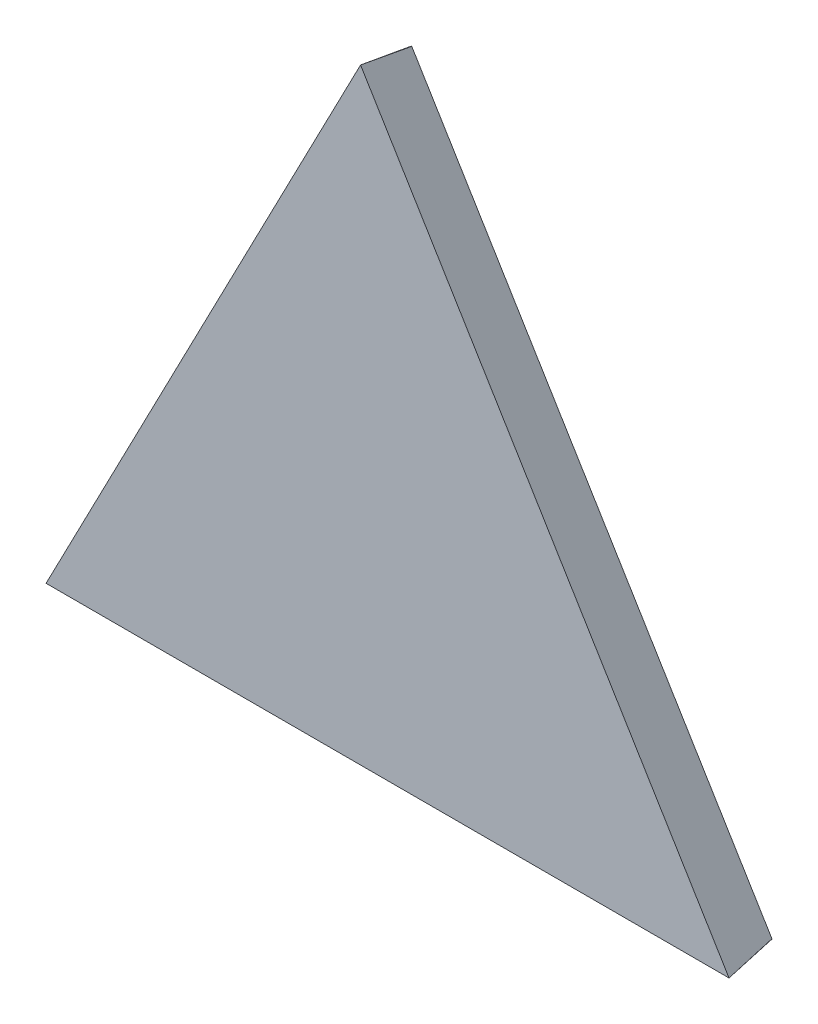
ISO-10303-21;
HEADER;
FILE_DESCRIPTION(('STEP AP214'),'2;1');
FILE_NAME('part.step','',(''),(''),'','','');
FILE_SCHEMA(('AUTOMOTIVE_DESIGN { 1 0 10303 214 1 1 1 1 }'));
ENDSEC;
DATA;
#1=APPLICATION_CONTEXT('core data for automotive mechanical design processes');
#2=APPLICATION_PROTOCOL_DEFINITION('international standard','automotive_design',2000,#1);
#3=PRODUCT_CONTEXT('',#1,'mechanical');
#4=PRODUCT('Part','Part','',(#3));
#5=PRODUCT_RELATED_PRODUCT_CATEGORY('part','',(#4));
#6=PRODUCT_DEFINITION_FORMATION('','',#4);
#7=PRODUCT_DEFINITION_CONTEXT('part definition',#1,'design');
#8=PRODUCT_DEFINITION('design','',#6,#7);
#9=PRODUCT_DEFINITION_SHAPE('','',#8);
#10=(LENGTH_UNIT() NAMED_UNIT(*) SI_UNIT(.MILLI.,.METRE.));
#11=(NAMED_UNIT(*) PLANE_ANGLE_UNIT() SI_UNIT($,.RADIAN.));
#12=(NAMED_UNIT(*) SI_UNIT($,.STERADIAN.) SOLID_ANGLE_UNIT());
#13=UNCERTAINTY_MEASURE_WITH_UNIT(LENGTH_MEASURE(1.E-05),#10,'distance_accuracy_value','');
#14=(GEOMETRIC_REPRESENTATION_CONTEXT(3) GLOBAL_UNCERTAINTY_ASSIGNED_CONTEXT((#13)) GLOBAL_UNIT_ASSIGNED_CONTEXT((#10,
#11,#12)) REPRESENTATION_CONTEXT('',''));
#15=CARTESIAN_POINT('',(0.,0.,0.));
#16=DIRECTION('',(0.,0.,1.));
#17=DIRECTION('',(1.,0.,0.));
#18=AXIS2_PLACEMENT_3D('',#15,#16,#17);
#19=CARTESIAN_POINT('',(-0.923470053492009,-0.561092901979246,1878.92454054814));
#20=DIRECTION('',(-0.000491488551482474,-0.000298624450893751,0.999999834631207));
#21=DIRECTION('',(0.999999879219484,0.,0.000491488573397105));
#22=AXIS2_PLACEMENT_3D('',#19,#20,#21);
#23=PLANE('',#22);
#24=DIRECTION('',(-0.999999879219492,7.3385255679394E-08,-0.000491488551482474));
#25=VECTOR('',#24,1.);
#26=CARTESIAN_POINT('',(-1935.37091675411,-203.166619934819,1877.91327864316));
#27=LINE('',#26,#25);
#28=CARTESIAN_POINT('',(-1014.25936340932,-203.166687530834,1878.36599448094));
#29=VERTEX_POINT('',#28);
#30=CARTESIAN_POINT('',(-1929.93068813402,-203.166620334053,1877.91595245357));
#31=VERTEX_POINT('',#30);
#32=EDGE_CURVE('E101',#29,#31,#27,.T.);
#33=ORIENTED_EDGE('',*,*,#32,.T.);
#34=DIRECTION('',(0.519258489732871,-0.854617236451698,1.62253873924349E-12));
#35=VECTOR('',#34,1.);
#36=CARTESIAN_POINT('',(-1931.28083918123,-200.94448554074,1877.91595245356));
#37=LINE('',#36,#35);
#38=CARTESIAN_POINT('',(-1931.28083918123,-200.94448554074,1877.91595245356));
#39=VERTEX_POINT('',#38);
#40=EDGE_CURVE('E87',#39,#31,#37,.T.);
#41=ORIENTED_EDGE('',*,*,#40,.F.);
#42=DIRECTION('',(0.460741120909903,0.887534437608869,0.00049148855148153));
#43=VECTOR('',#42,1.);
#44=CARTESIAN_POINT('',(-1504.26914390125,621.616314055967,1878.37146065558));
#45=LINE('',#44,#43);
#46=CARTESIAN_POINT('',(-1509.39335568673,611.745446840482,1878.36599448094));
#47=VERTEX_POINT('',#46);
#48=EDGE_CURVE('E98',#39,#47,#45,.T.);
#49=ORIENTED_EDGE('',*,*,#48,.T.);
#50=DIRECTION('',(-0.880409642345697,0.474213851469806,-0.000291099456965081));
#51=VECTOR('',#50,1.);
#52=CARTESIAN_POINT('',(-84.5068387603872,-155.739245056748,1878.8371202744));
#53=LINE('',#52,#51);
#54=CARTESIAN_POINT('',(-1509.00784526396,611.537799884375,1878.36612194647));
#55=VERTEX_POINT('',#54);
#56=EDGE_CURVE('E130',#55,#47,#53,.T.);
#57=ORIENTED_EDGE('',*,*,#56,.F.);
#58=DIRECTION('',(0.519258489728188,-0.854617236454544,0.));
#59=VECTOR('',#58,1.);
#60=CARTESIAN_POINT('',(-1011.99791536674,-206.461830707272,1878.36612194647));
#61=LINE('',#60,#59);
#62=CARTESIAN_POINT('',(-1014.2660366981,-202.728862209888,1878.36612194647));
#63=VERTEX_POINT('',#62);
#64=EDGE_CURVE('E122',#55,#63,#61,.T.);
#65=ORIENTED_EDGE('',*,*,#64,.T.);
#66=DIRECTION('',(-0.0152401269602711,0.999883820146791,0.000291099456963535));
#67=VECTOR('',#66,1.);
#68=CARTESIAN_POINT('',(-1017.1113832557,-16.0495784301313,1878.42047049881));
#69=LINE('',#68,#67);
#70=EDGE_CURVE('E133',#29,#63,#69,.T.);
#71=ORIENTED_EDGE('',*,*,#70,.F.);
#72=EDGE_LOOP('',(#33,#41,#49,#57,#65,#71));
#73=FACE_BOUND('',#72,.T.);
#74=ADVANCED_FACE('F36',(#73),#23,.F.);
#75=CARTESIAN_POINT('',(-1003.1720961849,-208.844251558157,1948.36975986285));
#76=DIRECTION('',(0.851171191290255,0.517164700682969,-0.0897121813636458));
#77=DIRECTION('',(0.519258489728188,-0.854617236454544,0.));
#78=AXIS2_PLACEMENT_3D('',#75,#76,#77);
#79=PLANE('',#78);
#80=DIRECTION('',(-0.519258489728188,0.854617236454544,0.));
#81=VECTOR('',#80,1.);
#82=CARTESIAN_POINT('',(-1003.1720961849,-208.844251558157,1948.36975986285));
#83=LINE('',#82,#81);
#84=CARTESIAN_POINT('',(-1003.1720961849,-208.844251558157,1948.36975986285));
#85=VERTEX_POINT('',#84);
#86=CARTESIAN_POINT('',(-1509.32402843142,624.201667034496,1948.36975986285));
#87=VERTEX_POINT('',#86);
#88=EDGE_CURVE('E117',#85,#87,#83,.T.);
#89=ORIENTED_EDGE('',*,*,#88,.F.);
#90=DIRECTION('',(-0.155943903522074,0.0859620335434603,-0.984018306609878));
#91=VECTOR('',#90,1.);
#92=CARTESIAN_POINT('',(-1003.1720961849,-208.844251558146,1948.36975986285));
#93=LINE('',#92,#91);
#94=EDGE_CURVE('E61',#85,#63,#93,.T.);
#95=ORIENTED_EDGE('',*,*,#94,.T.);
#96=ORIENTED_EDGE('',*,*,#64,.F.);
#97=DIRECTION('',(-0.00444448366224941,0.178011850228028,0.984018306609877));
#98=VECTOR('',#97,1.);
#99=CARTESIAN_POINT('',(-1508.65494861956,597.403473068757,1800.2340407375));
#100=LINE('',#99,#98);
#101=CARTESIAN_POINT('',(-1509.32402821771,624.201614949083,1948.36946163318));
#102=VERTEX_POINT('',#101);
#103=EDGE_CURVE('E45',#55,#102,#100,.T.);
#104=ORIENTED_EDGE('',*,*,#103,.T.);
#105=DIRECTION('',(0.000705906861904976,-0.172044465482195,-0.985088931819076));
#106=VECTOR('',#105,1.);
#107=CARTESIAN_POINT('',(-1509.32402843142,624.201667034496,1948.36975986285));
#108=LINE('',#107,#106);
#109=EDGE_CURVE('E107',#87,#102,#108,.T.);
#110=ORIENTED_EDGE('',*,*,#109,.F.);
#111=EDGE_LOOP('',(#89,#95,#96,#104,#110));
#112=FACE_BOUND('',#111,.T.);
#113=ADVANCED_FACE('F38',(#112),#79,.T.);
#114=CARTESIAN_POINT('',(-1941.77877306088,-208.844182678258,1947.90844537111));
#115=DIRECTION('',(3.96610068050898E-05,-0.996726725318335,-0.0808445017499255));
#116=DIRECTION('',(-0.999999879219492,7.33852556793941E-08,-0.000491488551482474));
#117=AXIS2_PLACEMENT_3D('',#114,#115,#116);
#118=PLANE('',#117);
#119=DIRECTION('',(-0.166370888621585,-0.0797243688108076,0.982835058612065));
#120=VECTOR('',#119,1.);
#121=CARTESIAN_POINT('',(-1929.93068813402,-203.166620334053,1877.91595245357));
#122=LINE('',#121,#120);
#123=CARTESIAN_POINT('',(-1941.77877306088,-208.844182678258,1947.9084453711));
#124=VERTEX_POINT('',#123);
#125=EDGE_CURVE('E89',#31,#124,#122,.T.);
#126=ORIENTED_EDGE('',*,*,#125,.F.);
#127=ORIENTED_EDGE('',*,*,#32,.F.);
#128=DIRECTION('',(0.155931667344667,-0.0798494351508652,0.984535110001263));
#129=VECTOR('',#128,1.);
#130=CARTESIAN_POINT('',(-1026.06484371149,-197.121341195065,1803.82751204288));
#131=LINE('',#130,#129);
#132=EDGE_CURVE('E12',#29,#85,#131,.T.);
#133=ORIENTED_EDGE('',*,*,#132,.T.);
#134=DIRECTION('',(0.999999879219492,-7.3385255679394E-08,0.000491488551482474));
#135=VECTOR('',#134,1.);
#136=CARTESIAN_POINT('',(-1941.77877306088,-208.844182678258,1947.9084453711));
#137=LINE('',#136,#135);
#138=EDGE_CURVE('E105',#124,#85,#137,.T.);
#139=ORIENTED_EDGE('',*,*,#138,.F.);
#140=EDGE_LOOP('',(#126,#127,#133,#139));
#141=FACE_BOUND('',#140,.T.);
#142=ADVANCED_FACE('F145',(#141),#118,.T.);
#143=CARTESIAN_POINT('',(-1509.32402843142,624.201667034496,1948.36975986285));
#144=DIRECTION('',(-0.88461109328866,0.459268309561467,-0.0808445017499295));
#145=DIRECTION('',(0.460741120909903,0.887534437608869,0.00049148855148153));
#146=AXIS2_PLACEMENT_3D('',#143,#144,#145);
#147=PLANE('',#146);
#148=DIRECTION('',(0.147412058491292,0.110927600597427,-0.982835058612104));
#149=VECTOR('',#148,1.);
#150=CARTESIAN_POINT('',(-1941.77877306088,-208.844182678263,1947.9084453711));
#151=LINE('',#150,#149);
#152=EDGE_CURVE('E84',#124,#39,#151,.T.);
#153=ORIENTED_EDGE('',*,*,#152,.F.);
#154=DIRECTION('',(-0.460741120909902,-0.887534437608868,-0.00049148855148153));
#155=VECTOR('',#154,1.);
#156=CARTESIAN_POINT('',(-1509.32402843142,624.201667034496,1948.36975986285));
#157=LINE('',#156,#155);
#158=EDGE_CURVE('E110',#87,#124,#157,.T.);
#159=ORIENTED_EDGE('',*,*,#158,.F.);
#160=ORIENTED_EDGE('',*,*,#109,.T.);
#161=DIRECTION('',(-0.00097502065145496,-0.175184664024938,-0.984535110001263));
#162=VECTOR('',#161,1.);
#163=CARTESIAN_POINT('',(-1509.32402843142,624.201667034493,1948.36975986285));
#164=LINE('',#163,#162);
#165=EDGE_CURVE('E53',#102,#47,#164,.T.);
#166=ORIENTED_EDGE('',*,*,#165,.T.);
#167=ORIENTED_EDGE('',*,*,#48,.F.);
#168=EDGE_LOOP('',(#153,#159,#160,#166,#167));
#169=FACE_BOUND('',#168,.T.);
#170=ADVANCED_FACE('F103',(#169),#147,.T.);
#171=CARTESIAN_POINT('',(-0.957874252095782,-0.581996613541801,1948.92452897233));
#172=DIRECTION('',(-0.000491488551482474,-0.000298624450893751,0.999999834631207));
#173=DIRECTION('',(0.999999879219484,0.,0.000491488573397105));
#174=AXIS2_PLACEMENT_3D('',#171,#172,#173);
#175=PLANE('',#174);
#176=ORIENTED_EDGE('',*,*,#88,.T.);
#177=ORIENTED_EDGE('',*,*,#158,.T.);
#178=ORIENTED_EDGE('',*,*,#138,.T.);
#179=EDGE_LOOP('',(#176,#177,#178));
#180=FACE_BOUND('',#179,.T.);
#181=ADVANCED_FACE('F146',(#180),#175,.T.);
#182=CARTESIAN_POINT('',(-218.638471317221,-405.872438464412,72.4360188576877));
#183=DIRECTION('',(0.468506259377159,0.869717835034414,-0.155218466515666));
#184=DIRECTION('',(-0.880387988965158,0.474254139555876,0.));
#185=AXIS2_PLACEMENT_3D('',#182,#183,#184);
#186=PLANE('',#185);
#187=ORIENTED_EDGE('',*,*,#56,.T.);
#188=ORIENTED_EDGE('',*,*,#165,.F.);
#189=ORIENTED_EDGE('',*,*,#103,.F.);
#190=EDGE_LOOP('',(#187,#188,#189));
#191=FACE_BOUND('',#190,.T.);
#192=ADVANCED_FACE('F148',(#191),#186,.T.);
#193=CARTESIAN_POINT('',(-1280.6119805293,-19.577543612566,201.236810687362));
#194=DIRECTION('',(0.987764749105298,0.0151005985798849,-0.15521846651567));
#195=DIRECTION('',(-0.155236166627073,0.,-0.987877387417554));
#196=AXIS2_PLACEMENT_3D('',#193,#194,#195);
#197=PLANE('',#196);
#198=ORIENTED_EDGE('',*,*,#70,.T.);
#199=ORIENTED_EDGE('',*,*,#94,.F.);
#200=ORIENTED_EDGE('',*,*,#132,.F.);
#201=EDGE_LOOP('',(#198,#199,#200));
#202=FACE_BOUND('',#201,.T.);
#203=ADVANCED_FACE('F154',(#202),#197,.T.);
#204=CARTESIAN_POINT('',(-1159.49462526491,-704.499514271313,-253.421902360515));
#205=DIRECTION('',(0.840087781257772,0.51043051079788,0.183611583044232));
#206=DIRECTION('',(-0.519258489732666,0.854617236451823,0.));
#207=AXIS2_PLACEMENT_3D('',#204,#205,#206);
#208=PLANE('',#207);
#209=ORIENTED_EDGE('',*,*,#152,.T.);
#210=ORIENTED_EDGE('',*,*,#40,.T.);
#211=ORIENTED_EDGE('',*,*,#125,.T.);
#212=EDGE_LOOP('',(#209,#210,#211));
#213=FACE_BOUND('',#212,.T.);
#214=ADVANCED_FACE('F86',(#213),#208,.F.);
#215=CLOSED_SHELL('',(#74,#113,#142,#170,#181,#192,#203,#214));
#216=MANIFOLD_SOLID_BREP('B2',#215);
#217=ADVANCED_BREP_SHAPE_REPRESENTATION('',(#18,#216),#14);
#218=SHAPE_DEFINITION_REPRESENTATION(#9,#217);
ENDSEC;
END-ISO-10303-21;
